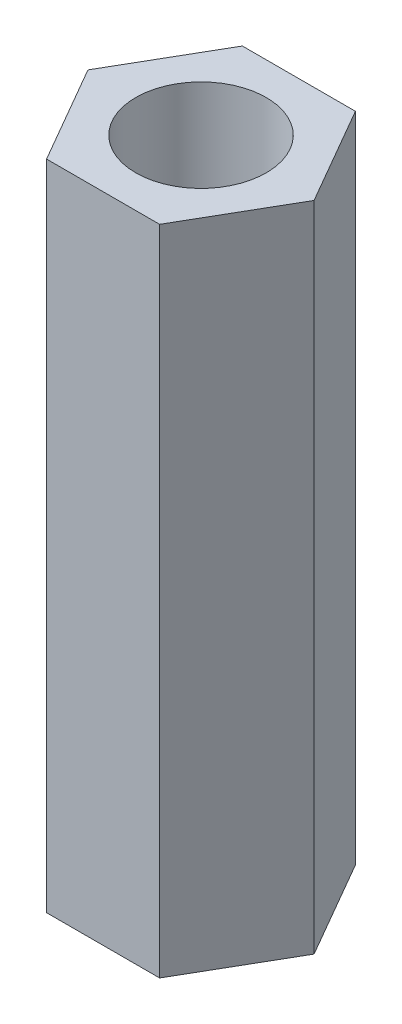
ISO-10303-21;
HEADER;
FILE_DESCRIPTION(('STEP AP214'),'2;1');
FILE_NAME('part.step','',(''),(''),'','','');
FILE_SCHEMA(('AUTOMOTIVE_DESIGN { 1 0 10303 214 1 1 1 1 }'));
ENDSEC;
DATA;
#1=APPLICATION_CONTEXT('core data for automotive mechanical design processes');
#2=APPLICATION_PROTOCOL_DEFINITION('international standard','automotive_design',2000,#1);
#3=PRODUCT_CONTEXT('',#1,'mechanical');
#4=PRODUCT('Part','Part','',(#3));
#5=PRODUCT_RELATED_PRODUCT_CATEGORY('part','',(#4));
#6=PRODUCT_DEFINITION_FORMATION('','',#4);
#7=PRODUCT_DEFINITION_CONTEXT('part definition',#1,'design');
#8=PRODUCT_DEFINITION('design','',#6,#7);
#9=PRODUCT_DEFINITION_SHAPE('','',#8);
#10=(LENGTH_UNIT() NAMED_UNIT(*) SI_UNIT(.MILLI.,.METRE.));
#11=(NAMED_UNIT(*) PLANE_ANGLE_UNIT() SI_UNIT($,.RADIAN.));
#12=(NAMED_UNIT(*) SI_UNIT($,.STERADIAN.) SOLID_ANGLE_UNIT());
#13=UNCERTAINTY_MEASURE_WITH_UNIT(LENGTH_MEASURE(1.E-05),#10,'distance_accuracy_value','');
#14=(GEOMETRIC_REPRESENTATION_CONTEXT(3) GLOBAL_UNCERTAINTY_ASSIGNED_CONTEXT((#13)) GLOBAL_UNIT_ASSIGNED_CONTEXT((#10,
#11,#12)) REPRESENTATION_CONTEXT('',''));
#15=CARTESIAN_POINT('',(0.,0.,0.));
#16=DIRECTION('',(0.,0.,1.));
#17=DIRECTION('',(1.,0.,0.));
#18=AXIS2_PLACEMENT_3D('',#15,#16,#17);
#19=CARTESIAN_POINT('',(0.,20.,0.));
#20=DIRECTION('',(0.,1.,0.));
#21=DIRECTION('',(0.,0.,1.));
#22=AXIS2_PLACEMENT_3D('',#19,#20,#21);
#23=PLANE('',#22);
#24=DIRECTION('',(1.,0.,0.));
#25=VECTOR('',#24,1.);
#26=CARTESIAN_POINT('',(-1.73205080756888,20.,3.));
#27=LINE('',#26,#25);
#28=CARTESIAN_POINT('',(-1.73205080756888,20.,3.));
#29=VERTEX_POINT('',#28);
#30=CARTESIAN_POINT('',(1.73205080756887,20.,3.));
#31=VERTEX_POINT('',#30);
#32=EDGE_CURVE('E130',#29,#31,#27,.T.);
#33=ORIENTED_EDGE('',*,*,#32,.T.);
#34=DIRECTION('',(0.5,0.,-0.866025403784438));
#35=VECTOR('',#34,1.);
#36=CARTESIAN_POINT('',(1.73205080756887,20.,3.));
#37=LINE('',#36,#35);
#38=CARTESIAN_POINT('',(3.46410161513775,20.,0.));
#39=VERTEX_POINT('',#38);
#40=EDGE_CURVE('E88',#31,#39,#37,.T.);
#41=ORIENTED_EDGE('',*,*,#40,.T.);
#42=DIRECTION('',(-0.5,0.,-0.866025403784439));
#43=VECTOR('',#42,1.);
#44=CARTESIAN_POINT('',(3.46410161513775,20.,0.));
#45=LINE('',#44,#43);
#46=CARTESIAN_POINT('',(1.73205080756888,20.,-3.));
#47=VERTEX_POINT('',#46);
#48=EDGE_CURVE('E101',#39,#47,#45,.T.);
#49=ORIENTED_EDGE('',*,*,#48,.T.);
#50=DIRECTION('',(-1.,0.,0.));
#51=VECTOR('',#50,1.);
#52=CARTESIAN_POINT('',(1.73205080756888,20.,-3.));
#53=LINE('',#52,#51);
#54=CARTESIAN_POINT('',(-1.73205080756888,20.,-3.));
#55=VERTEX_POINT('',#54);
#56=EDGE_CURVE('E95',#47,#55,#53,.T.);
#57=ORIENTED_EDGE('',*,*,#56,.T.);
#58=DIRECTION('',(-0.5,0.,0.866025403784439));
#59=VECTOR('',#58,1.);
#60=CARTESIAN_POINT('',(-1.73205080756888,20.,-3.));
#61=LINE('',#60,#59);
#62=CARTESIAN_POINT('',(-3.46410161513776,20.,0.));
#63=VERTEX_POINT('',#62);
#64=EDGE_CURVE('E99',#55,#63,#61,.T.);
#65=ORIENTED_EDGE('',*,*,#64,.T.);
#66=DIRECTION('',(0.5,0.,0.866025403784439));
#67=VECTOR('',#66,1.);
#68=CARTESIAN_POINT('',(-3.46410161513776,20.,0.));
#69=LINE('',#68,#67);
#70=EDGE_CURVE('E51',#63,#29,#69,.T.);
#71=ORIENTED_EDGE('',*,*,#70,.T.);
#72=EDGE_LOOP('',(#33,#41,#49,#57,#65,#71));
#73=FACE_BOUND('',#72,.T.);
#74=CARTESIAN_POINT('',(0.,20.,0.));
#75=DIRECTION('',(0.,1.,0.));
#76=DIRECTION('',(0.,0.,1.));
#77=AXIS2_PLACEMENT_3D('',#74,#75,#76);
#78=CIRCLE('',#77,2.);
#79=CARTESIAN_POINT('',(0.,20.,2.));
#80=VERTEX_POINT('',#79);
#81=EDGE_CURVE('E123',#80,#80,#78,.T.);
#82=ORIENTED_EDGE('',*,*,#81,.F.);
#83=EDGE_LOOP('',(#82));
#84=FACE_BOUND('',#83,.T.);
#85=ADVANCED_FACE('F34',(#73,#84),#23,.T.);
#86=CARTESIAN_POINT('',(0.,0.,0.));
#87=DIRECTION('',(0.,1.,0.));
#88=DIRECTION('',(0.,0.,1.));
#89=AXIS2_PLACEMENT_3D('',#86,#87,#88);
#90=PLANE('',#89);
#91=DIRECTION('',(1.,0.,0.));
#92=VECTOR('',#91,1.);
#93=CARTESIAN_POINT('',(-1.73205080756888,0.,3.));
#94=LINE('',#93,#92);
#95=CARTESIAN_POINT('',(-1.73205080756888,0.,3.));
#96=VERTEX_POINT('',#95);
#97=CARTESIAN_POINT('',(1.73205080756887,0.,3.));
#98=VERTEX_POINT('',#97);
#99=EDGE_CURVE('E119',#96,#98,#94,.T.);
#100=ORIENTED_EDGE('',*,*,#99,.F.);
#101=DIRECTION('',(0.5,0.,0.866025403784439));
#102=VECTOR('',#101,1.);
#103=CARTESIAN_POINT('',(-3.46410161513776,0.,0.));
#104=LINE('',#103,#102);
#105=CARTESIAN_POINT('',(-3.46410161513776,0.,0.));
#106=VERTEX_POINT('',#105);
#107=EDGE_CURVE('E80',#106,#96,#104,.T.);
#108=ORIENTED_EDGE('',*,*,#107,.F.);
#109=DIRECTION('',(-0.5,0.,0.866025403784439));
#110=VECTOR('',#109,1.);
#111=CARTESIAN_POINT('',(-1.73205080756888,0.,-3.));
#112=LINE('',#111,#110);
#113=CARTESIAN_POINT('',(-1.73205080756888,0.,-3.));
#114=VERTEX_POINT('',#113);
#115=EDGE_CURVE('E74',#114,#106,#112,.T.);
#116=ORIENTED_EDGE('',*,*,#115,.F.);
#117=DIRECTION('',(-1.,0.,0.));
#118=VECTOR('',#117,1.);
#119=CARTESIAN_POINT('',(1.73205080756888,0.,-3.));
#120=LINE('',#119,#118);
#121=CARTESIAN_POINT('',(1.73205080756888,0.,-3.));
#122=VERTEX_POINT('',#121);
#123=EDGE_CURVE('E109',#122,#114,#120,.T.);
#124=ORIENTED_EDGE('',*,*,#123,.F.);
#125=DIRECTION('',(-0.5,0.,-0.866025403784439));
#126=VECTOR('',#125,1.);
#127=CARTESIAN_POINT('',(3.46410161513775,0.,0.));
#128=LINE('',#127,#126);
#129=CARTESIAN_POINT('',(3.46410161513775,0.,0.));
#130=VERTEX_POINT('',#129);
#131=EDGE_CURVE('E125',#130,#122,#128,.T.);
#132=ORIENTED_EDGE('',*,*,#131,.F.);
#133=DIRECTION('',(0.5,0.,-0.866025403784438));
#134=VECTOR('',#133,1.);
#135=CARTESIAN_POINT('',(1.73205080756887,0.,3.));
#136=LINE('',#135,#134);
#137=EDGE_CURVE('E122',#98,#130,#136,.T.);
#138=ORIENTED_EDGE('',*,*,#137,.F.);
#139=EDGE_LOOP('',(#100,#108,#116,#124,#132,#138));
#140=FACE_BOUND('',#139,.T.);
#141=CARTESIAN_POINT('',(0.,0.,0.));
#142=DIRECTION('',(0.,1.,0.));
#143=DIRECTION('',(0.,0.,1.));
#144=AXIS2_PLACEMENT_3D('',#141,#142,#143);
#145=CIRCLE('',#144,2.);
#146=CARTESIAN_POINT('',(0.,0.,2.));
#147=VERTEX_POINT('',#146);
#148=EDGE_CURVE('E223',#147,#147,#145,.T.);
#149=ORIENTED_EDGE('',*,*,#148,.T.);
#150=EDGE_LOOP('',(#149));
#151=FACE_BOUND('',#150,.T.);
#152=ADVANCED_FACE('F139',(#140,#151),#90,.F.);
#153=CARTESIAN_POINT('',(-1.73205080756888,20.,3.));
#154=DIRECTION('',(0.,0.,-1.));
#155=DIRECTION('',(-1.,0.,0.));
#156=AXIS2_PLACEMENT_3D('',#153,#154,#155);
#157=PLANE('',#156);
#158=ORIENTED_EDGE('',*,*,#99,.T.);
#159=DIRECTION('',(0.,-1.,0.));
#160=VECTOR('',#159,1.);
#161=CARTESIAN_POINT('',(1.73205080756887,20.,3.));
#162=LINE('',#161,#160);
#163=EDGE_CURVE('E11',#31,#98,#162,.T.);
#164=ORIENTED_EDGE('',*,*,#163,.F.);
#165=ORIENTED_EDGE('',*,*,#32,.F.);
#166=DIRECTION('',(0.,-1.,0.));
#167=VECTOR('',#166,1.);
#168=CARTESIAN_POINT('',(-1.73205080756888,20.,3.));
#169=LINE('',#168,#167);
#170=EDGE_CURVE('E115',#29,#96,#169,.T.);
#171=ORIENTED_EDGE('',*,*,#170,.T.);
#172=EDGE_LOOP('',(#158,#164,#165,#171));
#173=FACE_BOUND('',#172,.T.);
#174=ADVANCED_FACE('F36',(#173),#157,.F.);
#175=CARTESIAN_POINT('',(1.73205080756887,20.,3.));
#176=DIRECTION('',(-0.866025403784438,0.,-0.5));
#177=DIRECTION('',(-0.5,0.,0.866025403784439));
#178=AXIS2_PLACEMENT_3D('',#175,#176,#177);
#179=PLANE('',#178);
#180=ORIENTED_EDGE('',*,*,#137,.T.);
#181=DIRECTION('',(0.,-1.,0.));
#182=VECTOR('',#181,1.);
#183=CARTESIAN_POINT('',(3.46410161513775,20.,0.));
#184=LINE('',#183,#182);
#185=EDGE_CURVE('E43',#39,#130,#184,.T.);
#186=ORIENTED_EDGE('',*,*,#185,.F.);
#187=ORIENTED_EDGE('',*,*,#40,.F.);
#188=ORIENTED_EDGE('',*,*,#163,.T.);
#189=EDGE_LOOP('',(#180,#186,#187,#188));
#190=FACE_BOUND('',#189,.T.);
#191=ADVANCED_FACE('F164',(#190),#179,.F.);
#192=CARTESIAN_POINT('',(3.46410161513775,20.,0.));
#193=DIRECTION('',(-0.866025403784438,0.,0.5));
#194=DIRECTION('',(0.5,0.,0.866025403784439));
#195=AXIS2_PLACEMENT_3D('',#192,#193,#194);
#196=PLANE('',#195);
#197=ORIENTED_EDGE('',*,*,#131,.T.);
#198=DIRECTION('',(0.,-1.,0.));
#199=VECTOR('',#198,1.);
#200=CARTESIAN_POINT('',(1.73205080756888,20.,-3.));
#201=LINE('',#200,#199);
#202=EDGE_CURVE('E110',#47,#122,#201,.T.);
#203=ORIENTED_EDGE('',*,*,#202,.F.);
#204=ORIENTED_EDGE('',*,*,#48,.F.);
#205=ORIENTED_EDGE('',*,*,#185,.T.);
#206=EDGE_LOOP('',(#197,#203,#204,#205));
#207=FACE_BOUND('',#206,.T.);
#208=ADVANCED_FACE('F136',(#207),#196,.F.);
#209=CARTESIAN_POINT('',(1.73205080756888,20.,-3.));
#210=DIRECTION('',(0.,0.,1.));
#211=DIRECTION('',(1.,0.,0.));
#212=AXIS2_PLACEMENT_3D('',#209,#210,#211);
#213=PLANE('',#212);
#214=ORIENTED_EDGE('',*,*,#123,.T.);
#215=DIRECTION('',(0.,-1.,0.));
#216=VECTOR('',#215,1.);
#217=CARTESIAN_POINT('',(-1.73205080756888,20.,-3.));
#218=LINE('',#217,#216);
#219=EDGE_CURVE('E106',#55,#114,#218,.T.);
#220=ORIENTED_EDGE('',*,*,#219,.F.);
#221=ORIENTED_EDGE('',*,*,#56,.F.);
#222=ORIENTED_EDGE('',*,*,#202,.T.);
#223=EDGE_LOOP('',(#214,#220,#221,#222));
#224=FACE_BOUND('',#223,.T.);
#225=ADVANCED_FACE('F107',(#224),#213,.F.);
#226=CARTESIAN_POINT('',(-1.73205080756888,20.,-3.));
#227=DIRECTION('',(0.866025403784439,0.,0.5));
#228=DIRECTION('',(0.5,0.,-0.866025403784439));
#229=AXIS2_PLACEMENT_3D('',#226,#227,#228);
#230=PLANE('',#229);
#231=ORIENTED_EDGE('',*,*,#115,.T.);
#232=DIRECTION('',(0.,-1.,0.));
#233=VECTOR('',#232,1.);
#234=CARTESIAN_POINT('',(-3.46410161513776,20.,0.));
#235=LINE('',#234,#233);
#236=EDGE_CURVE('E111',#63,#106,#235,.T.);
#237=ORIENTED_EDGE('',*,*,#236,.F.);
#238=ORIENTED_EDGE('',*,*,#64,.F.);
#239=ORIENTED_EDGE('',*,*,#219,.T.);
#240=EDGE_LOOP('',(#231,#237,#238,#239));
#241=FACE_BOUND('',#240,.T.);
#242=ADVANCED_FACE('F113',(#241),#230,.F.);
#243=CARTESIAN_POINT('',(-3.46410161513776,20.,0.));
#244=DIRECTION('',(0.866025403784439,0.,-0.5));
#245=DIRECTION('',(-0.5,0.,-0.866025403784439));
#246=AXIS2_PLACEMENT_3D('',#243,#244,#245);
#247=PLANE('',#246);
#248=ORIENTED_EDGE('',*,*,#107,.T.);
#249=ORIENTED_EDGE('',*,*,#170,.F.);
#250=ORIENTED_EDGE('',*,*,#70,.F.);
#251=ORIENTED_EDGE('',*,*,#236,.T.);
#252=EDGE_LOOP('',(#248,#249,#250,#251));
#253=FACE_BOUND('',#252,.T.);
#254=ADVANCED_FACE('F144',(#253),#247,.F.);
#255=CARTESIAN_POINT('',(0.,20.,0.));
#256=DIRECTION('',(0.,-1.,0.));
#257=DIRECTION('',(0.,0.,-1.));
#258=AXIS2_PLACEMENT_3D('',#255,#256,#257);
#259=CYLINDRICAL_SURFACE('',#258,2.);
#260=ORIENTED_EDGE('',*,*,#81,.T.);
#261=EDGE_LOOP('',(#260));
#262=FACE_BOUND('',#261,.T.);
#263=ORIENTED_EDGE('',*,*,#148,.F.);
#264=EDGE_LOOP('',(#263));
#265=FACE_BOUND('',#264,.T.);
#266=ADVANCED_FACE('F146',(#262,#265),#259,.F.);
#267=CLOSED_SHELL('',(#85,#152,#174,#191,#208,#225,#242,#254,#266));
#268=MANIFOLD_SOLID_BREP('B2',#267);
#269=ADVANCED_BREP_SHAPE_REPRESENTATION('',(#18,#268),#14);
#270=SHAPE_DEFINITION_REPRESENTATION(#9,#269);
ENDSEC;
END-ISO-10303-21;
